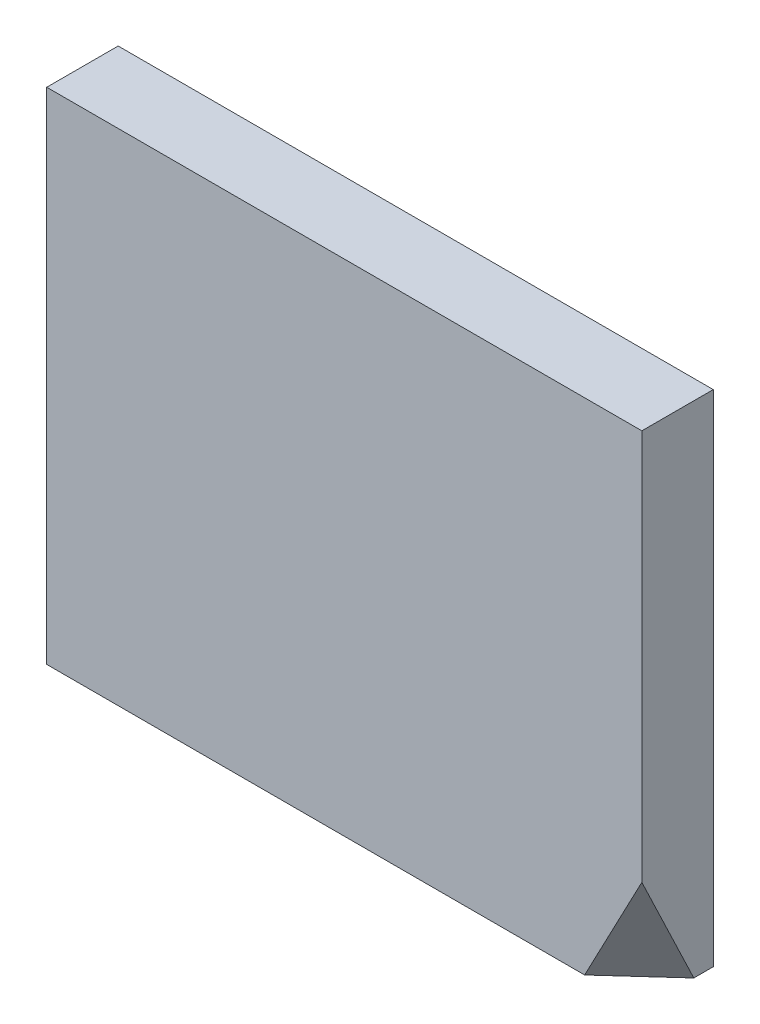
ISO-10303-21;
HEADER;
FILE_DESCRIPTION(('STEP AP214'),'2;1');
FILE_NAME('part.step','',(''),(''),'','','');
FILE_SCHEMA(('AUTOMOTIVE_DESIGN { 1 0 10303 214 1 1 1 1 }'));
ENDSEC;
DATA;
#1=APPLICATION_CONTEXT('core data for automotive mechanical design processes');
#2=APPLICATION_PROTOCOL_DEFINITION('international standard','automotive_design',2000,#1);
#3=PRODUCT_CONTEXT('',#1,'mechanical');
#4=PRODUCT('Part','Part','',(#3));
#5=PRODUCT_RELATED_PRODUCT_CATEGORY('part','',(#4));
#6=PRODUCT_DEFINITION_FORMATION('','',#4);
#7=PRODUCT_DEFINITION_CONTEXT('part definition',#1,'design');
#8=PRODUCT_DEFINITION('design','',#6,#7);
#9=PRODUCT_DEFINITION_SHAPE('','',#8);
#10=(LENGTH_UNIT() NAMED_UNIT(*) SI_UNIT(.MILLI.,.METRE.));
#11=(NAMED_UNIT(*) PLANE_ANGLE_UNIT() SI_UNIT($,.RADIAN.));
#12=(NAMED_UNIT(*) SI_UNIT($,.STERADIAN.) SOLID_ANGLE_UNIT());
#13=UNCERTAINTY_MEASURE_WITH_UNIT(LENGTH_MEASURE(1.E-05),#10,'distance_accuracy_value','');
#14=(GEOMETRIC_REPRESENTATION_CONTEXT(3) GLOBAL_UNCERTAINTY_ASSIGNED_CONTEXT((#13)) GLOBAL_UNIT_ASSIGNED_CONTEXT((#10,
#11,#12)) REPRESENTATION_CONTEXT('',''));
#15=CARTESIAN_POINT('',(0.,0.,0.));
#16=DIRECTION('',(0.,0.,1.));
#17=DIRECTION('',(1.,0.,0.));
#18=AXIS2_PLACEMENT_3D('',#15,#16,#17);
#19=CARTESIAN_POINT('',(-12.5,-10.5,3.));
#20=DIRECTION('',(0.,1.,0.));
#21=DIRECTION('',(0.,0.,1.));
#22=AXIS2_PLACEMENT_3D('',#19,#20,#21);
#23=PLANE('',#22);
#24=DIRECTION('',(0.740054153350203,0.,-0.672547284664144));
#25=VECTOR('',#24,1.);
#26=CARTESIAN_POINT('',(-2.27900234269827,-10.5,14.2469293091358));
#27=LINE('',#26,#25);
#28=CARTESIAN_POINT('',(10.0968364086522,-10.5,2.99999999999999));
#29=VERTEX_POINT('',#28);
#30=CARTESIAN_POINT('',(12.5,-10.5,0.816050162480633));
#31=VERTEX_POINT('',#30);
#32=EDGE_CURVE('E86',#29,#31,#27,.T.);
#33=ORIENTED_EDGE('',*,*,#32,.F.);
#34=DIRECTION('',(1.,0.,0.));
#35=VECTOR('',#34,1.);
#36=CARTESIAN_POINT('',(-12.5,-10.5,3.));
#37=LINE('',#36,#35);
#38=CARTESIAN_POINT('',(-12.5,-10.5,3.));
#39=VERTEX_POINT('',#38);
#40=EDGE_CURVE('E75',#39,#29,#37,.T.);
#41=ORIENTED_EDGE('',*,*,#40,.F.);
#42=DIRECTION('',(0.,0.,-1.));
#43=VECTOR('',#42,1.);
#44=CARTESIAN_POINT('',(-12.5,-10.5,3.));
#45=LINE('',#44,#43);
#46=CARTESIAN_POINT('',(-12.5,-10.5,0.));
#47=VERTEX_POINT('',#46);
#48=EDGE_CURVE('E40',#39,#47,#45,.T.);
#49=ORIENTED_EDGE('',*,*,#48,.T.);
#50=DIRECTION('',(1.,0.,0.));
#51=VECTOR('',#50,1.);
#52=CARTESIAN_POINT('',(-12.5,-10.5,0.));
#53=LINE('',#52,#51);
#54=CARTESIAN_POINT('',(12.5,-10.5,0.));
#55=VERTEX_POINT('',#54);
#56=EDGE_CURVE('E103',#47,#55,#53,.T.);
#57=ORIENTED_EDGE('',*,*,#56,.T.);
#58=DIRECTION('',(0.,0.,-1.));
#59=VECTOR('',#58,1.);
#60=CARTESIAN_POINT('',(12.5,-10.5,3.));
#61=LINE('',#60,#59);
#62=EDGE_CURVE('E88',#31,#55,#61,.T.);
#63=ORIENTED_EDGE('',*,*,#62,.F.);
#64=EDGE_LOOP('',(#33,#41,#49,#57,#63));
#65=FACE_BOUND('',#64,.T.);
#66=ADVANCED_FACE('F32',(#65),#23,.F.);
#67=CARTESIAN_POINT('',(12.5,-10.5,3.));
#68=DIRECTION('',(-1.,0.,0.));
#69=DIRECTION('',(0.,-1.,0.));
#70=AXIS2_PLACEMENT_3D('',#67,#68,#69);
#71=PLANE('',#70);
#72=DIRECTION('',(0.,0.902342236565688,0.431020287352732));
#73=VECTOR('',#72,1.);
#74=CARTESIAN_POINT('',(12.5,-9.65060117233616,1.22178106140226));
#75=LINE('',#74,#73);
#76=CARTESIAN_POINT('',(12.5,-5.9278946055229,3.));
#77=VERTEX_POINT('',#76);
#78=EDGE_CURVE('E47',#31,#77,#75,.T.);
#79=ORIENTED_EDGE('',*,*,#78,.F.);
#80=ORIENTED_EDGE('',*,*,#62,.T.);
#81=DIRECTION('',(0.,1.,0.));
#82=VECTOR('',#81,1.);
#83=CARTESIAN_POINT('',(12.5,-10.5,0.));
#84=LINE('',#83,#82);
#85=CARTESIAN_POINT('',(12.5,10.5,0.));
#86=VERTEX_POINT('',#85);
#87=EDGE_CURVE('E105',#55,#86,#84,.T.);
#88=ORIENTED_EDGE('',*,*,#87,.T.);
#89=DIRECTION('',(0.,0.,-1.));
#90=VECTOR('',#89,1.);
#91=CARTESIAN_POINT('',(12.5,10.5,3.));
#92=LINE('',#91,#90);
#93=CARTESIAN_POINT('',(12.5,10.5,3.));
#94=VERTEX_POINT('',#93);
#95=EDGE_CURVE('E110',#94,#86,#92,.T.);
#96=ORIENTED_EDGE('',*,*,#95,.F.);
#97=DIRECTION('',(0.,1.,0.));
#98=VECTOR('',#97,1.);
#99=CARTESIAN_POINT('',(12.5,-10.5,3.));
#100=LINE('',#99,#98);
#101=EDGE_CURVE('E83',#77,#94,#100,.T.);
#102=ORIENTED_EDGE('',*,*,#101,.F.);
#103=EDGE_LOOP('',(#79,#80,#88,#96,#102));
#104=FACE_BOUND('',#103,.T.);
#105=ADVANCED_FACE('F121',(#104),#71,.F.);
#106=CARTESIAN_POINT('',(-12.5,10.5,3.));
#107=DIRECTION('',(0.,0.,-1.));
#108=DIRECTION('',(-1.,0.,0.));
#109=AXIS2_PLACEMENT_3D('',#106,#107,#108);
#110=PLANE('',#109);
#111=DIRECTION('',(-0.465260058052575,-0.885174038469788,0.));
#112=VECTOR('',#111,1.);
#113=CARTESIAN_POINT('',(13.853927407968,-3.35199888706748,3.));
#114=LINE('',#113,#112);
#115=EDGE_CURVE('E11',#77,#29,#114,.T.);
#116=ORIENTED_EDGE('',*,*,#115,.F.);
#117=ORIENTED_EDGE('',*,*,#101,.T.);
#118=DIRECTION('',(-1.,0.,0.));
#119=VECTOR('',#118,1.);
#120=CARTESIAN_POINT('',(12.5,10.5,3.));
#121=LINE('',#120,#119);
#122=CARTESIAN_POINT('',(-12.5,10.5,3.));
#123=VERTEX_POINT('',#122);
#124=EDGE_CURVE('E98',#94,#123,#121,.T.);
#125=ORIENTED_EDGE('',*,*,#124,.T.);
#126=DIRECTION('',(0.,-1.,0.));
#127=VECTOR('',#126,1.);
#128=CARTESIAN_POINT('',(-12.5,10.5,3.));
#129=LINE('',#128,#127);
#130=EDGE_CURVE('E79',#123,#39,#129,.T.);
#131=ORIENTED_EDGE('',*,*,#130,.T.);
#132=ORIENTED_EDGE('',*,*,#40,.T.);
#133=EDGE_LOOP('',(#116,#117,#125,#131,#132));
#134=FACE_BOUND('',#133,.T.);
#135=ADVANCED_FACE('F77',(#134),#110,.F.);
#136=CARTESIAN_POINT('',(-12.5,10.5,3.));
#137=DIRECTION('',(1.,0.,0.));
#138=DIRECTION('',(0.,1.,0.));
#139=AXIS2_PLACEMENT_3D('',#136,#137,#138);
#140=PLANE('',#139);
#141=DIRECTION('',(0.,-1.,0.));
#142=VECTOR('',#141,1.);
#143=CARTESIAN_POINT('',(-12.5,10.5,0.));
#144=LINE('',#143,#142);
#145=CARTESIAN_POINT('',(-12.5,10.5,0.));
#146=VERTEX_POINT('',#145);
#147=EDGE_CURVE('E90',#146,#47,#144,.T.);
#148=ORIENTED_EDGE('',*,*,#147,.T.);
#149=ORIENTED_EDGE('',*,*,#48,.F.);
#150=ORIENTED_EDGE('',*,*,#130,.F.);
#151=DIRECTION('',(0.,0.,-1.));
#152=VECTOR('',#151,1.);
#153=CARTESIAN_POINT('',(-12.5,10.5,3.));
#154=LINE('',#153,#152);
#155=EDGE_CURVE('E100',#123,#146,#154,.T.);
#156=ORIENTED_EDGE('',*,*,#155,.T.);
#157=EDGE_LOOP('',(#148,#149,#150,#156));
#158=FACE_BOUND('',#157,.T.);
#159=ADVANCED_FACE('F34',(#158),#140,.F.);
#160=CARTESIAN_POINT('',(12.5,10.5,3.));
#161=DIRECTION('',(0.,-1.,0.));
#162=DIRECTION('',(1.,0.,0.));
#163=AXIS2_PLACEMENT_3D('',#160,#161,#162);
#164=PLANE('',#163);
#165=DIRECTION('',(-1.,0.,0.));
#166=VECTOR('',#165,1.);
#167=CARTESIAN_POINT('',(12.5,10.5,0.));
#168=LINE('',#167,#166);
#169=EDGE_CURVE('E95',#86,#146,#168,.T.);
#170=ORIENTED_EDGE('',*,*,#169,.T.);
#171=ORIENTED_EDGE('',*,*,#155,.F.);
#172=ORIENTED_EDGE('',*,*,#124,.F.);
#173=ORIENTED_EDGE('',*,*,#95,.T.);
#174=EDGE_LOOP('',(#170,#171,#172,#173));
#175=FACE_BOUND('',#174,.T.);
#176=ADVANCED_FACE('F124',(#175),#164,.F.);
#177=CARTESIAN_POINT('',(-12.5,10.5,0.));
#178=DIRECTION('',(0.,0.,-1.));
#179=DIRECTION('',(-1.,0.,0.));
#180=AXIS2_PLACEMENT_3D('',#177,#178,#179);
#181=PLANE('',#180);
#182=ORIENTED_EDGE('',*,*,#147,.F.);
#183=ORIENTED_EDGE('',*,*,#169,.F.);
#184=ORIENTED_EDGE('',*,*,#87,.F.);
#185=ORIENTED_EDGE('',*,*,#56,.F.);
#186=EDGE_LOOP('',(#182,#183,#184,#185));
#187=FACE_BOUND('',#186,.T.);
#188=ADVANCED_FACE('F119',(#187),#181,.T.);
#189=CARTESIAN_POINT('',(-15.1524058924932,17.9537286652666,39.5374805055179));
#190=DIRECTION('',(0.634094217244411,-0.333288934722871,0.697741363005298));
#191=DIRECTION('',(0.740054153350203,0.,-0.672547284664144));
#192=AXIS2_PLACEMENT_3D('',#189,#190,#191);
#193=PLANE('',#192);
#194=ORIENTED_EDGE('',*,*,#115,.T.);
#195=ORIENTED_EDGE('',*,*,#32,.T.);
#196=ORIENTED_EDGE('',*,*,#78,.T.);
#197=EDGE_LOOP('',(#194,#195,#196));
#198=FACE_BOUND('',#197,.T.);
#199=ADVANCED_FACE('F92',(#198),#193,.T.);
#200=CLOSED_SHELL('',(#66,#105,#135,#159,#176,#188,#199));
#201=MANIFOLD_SOLID_BREP('B2',#200);
#202=ADVANCED_BREP_SHAPE_REPRESENTATION('',(#18,#201),#14);
#203=SHAPE_DEFINITION_REPRESENTATION(#9,#202);
ENDSEC;
END-ISO-10303-21;
